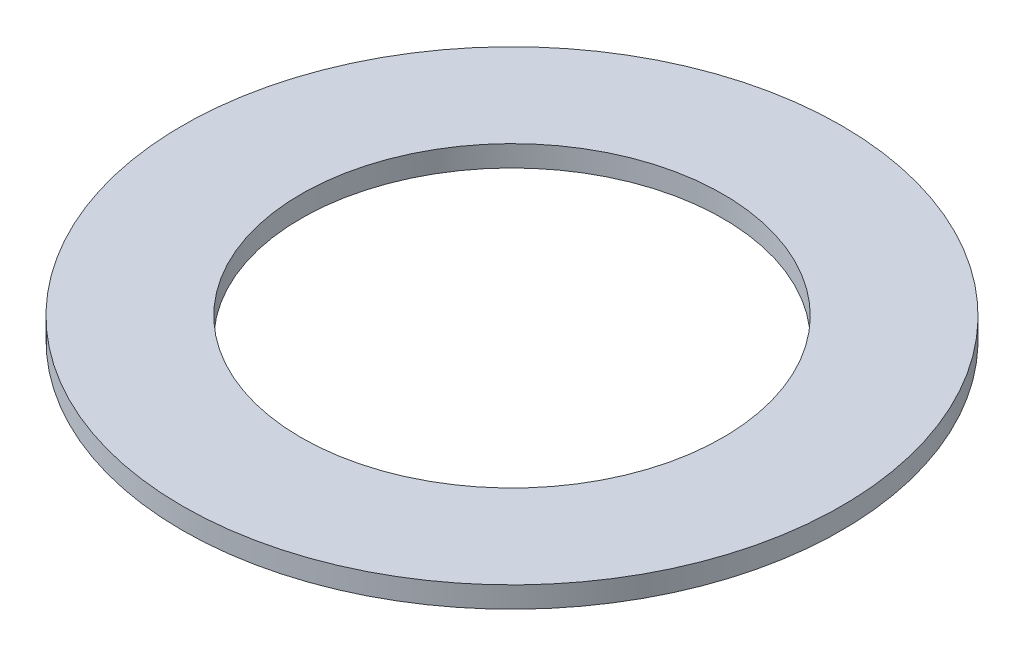
ISO-10303-21;
HEADER;
FILE_DESCRIPTION(('STEP AP214'),'2;1');
FILE_NAME('part.step','',(''),(''),'','','');
FILE_SCHEMA(('AUTOMOTIVE_DESIGN { 1 0 10303 214 1 1 1 1 }'));
ENDSEC;
DATA;
#1=APPLICATION_CONTEXT('core data for automotive mechanical design processes');
#2=APPLICATION_PROTOCOL_DEFINITION('international standard','automotive_design',2000,#1);
#3=PRODUCT_CONTEXT('',#1,'mechanical');
#4=PRODUCT('Part','Part','',(#3));
#5=PRODUCT_RELATED_PRODUCT_CATEGORY('part','',(#4));
#6=PRODUCT_DEFINITION_FORMATION('','',#4);
#7=PRODUCT_DEFINITION_CONTEXT('part definition',#1,'design');
#8=PRODUCT_DEFINITION('design','',#6,#7);
#9=PRODUCT_DEFINITION_SHAPE('','',#8);
#10=(LENGTH_UNIT() NAMED_UNIT(*) SI_UNIT(.MILLI.,.METRE.));
#11=(NAMED_UNIT(*) PLANE_ANGLE_UNIT() SI_UNIT($,.RADIAN.));
#12=(NAMED_UNIT(*) SI_UNIT($,.STERADIAN.) SOLID_ANGLE_UNIT());
#13=UNCERTAINTY_MEASURE_WITH_UNIT(LENGTH_MEASURE(1.E-05),#10,'distance_accuracy_value','');
#14=(GEOMETRIC_REPRESENTATION_CONTEXT(3) GLOBAL_UNCERTAINTY_ASSIGNED_CONTEXT((#13)) GLOBAL_UNIT_ASSIGNED_CONTEXT((#10,
#11,#12)) REPRESENTATION_CONTEXT('',''));
#15=CARTESIAN_POINT('',(0.,0.,0.));
#16=DIRECTION('',(0.,0.,1.));
#17=DIRECTION('',(1.,0.,0.));
#18=AXIS2_PLACEMENT_3D('',#15,#16,#17);
#19=CARTESIAN_POINT('',(0.,4.,0.));
#20=DIRECTION('',(0.,-1.,0.));
#21=DIRECTION('',(0.,0.,-1.));
#22=AXIS2_PLACEMENT_3D('',#19,#20,#21);
#23=CYLINDRICAL_SURFACE('',#22,62.5);
#24=CARTESIAN_POINT('',(0.,4.,0.));
#25=DIRECTION('',(0.,1.,0.));
#26=DIRECTION('',(0.,0.,1.));
#27=AXIS2_PLACEMENT_3D('',#24,#25,#26);
#28=CIRCLE('',#27,62.5);
#29=CARTESIAN_POINT('',(0.,4.,62.5));
#30=VERTEX_POINT('',#29);
#31=EDGE_CURVE('E10',#30,#30,#28,.T.);
#32=ORIENTED_EDGE('',*,*,#31,.F.);
#33=EDGE_LOOP('',(#32));
#34=FACE_BOUND('',#33,.T.);
#35=CARTESIAN_POINT('',(0.,0.,0.));
#36=DIRECTION('',(0.,1.,0.));
#37=DIRECTION('',(0.,0.,1.));
#38=AXIS2_PLACEMENT_3D('',#35,#36,#37);
#39=CIRCLE('',#38,62.5);
#40=CARTESIAN_POINT('',(0.,0.,62.5));
#41=VERTEX_POINT('',#40);
#42=EDGE_CURVE('E37',#41,#41,#39,.T.);
#43=ORIENTED_EDGE('',*,*,#42,.T.);
#44=EDGE_LOOP('',(#43));
#45=FACE_BOUND('',#44,.T.);
#46=ADVANCED_FACE('F40',(#34,#45),#23,.T.);
#47=CARTESIAN_POINT('',(0.,4.,0.));
#48=DIRECTION('',(0.,1.,0.));
#49=DIRECTION('',(0.,0.,1.));
#50=AXIS2_PLACEMENT_3D('',#47,#48,#49);
#51=PLANE('',#50);
#52=CARTESIAN_POINT('',(0.,4.,0.));
#53=DIRECTION('',(0.,1.,0.));
#54=DIRECTION('',(0.,0.,1.));
#55=AXIS2_PLACEMENT_3D('',#52,#53,#54);
#56=CIRCLE('',#55,40.);
#57=CARTESIAN_POINT('',(0.,4.,40.));
#58=VERTEX_POINT('',#57);
#59=EDGE_CURVE('E50',#58,#58,#56,.T.);
#60=ORIENTED_EDGE('',*,*,#59,.F.);
#61=EDGE_LOOP('',(#60));
#62=FACE_BOUND('',#61,.T.);
#63=ORIENTED_EDGE('',*,*,#31,.T.);
#64=EDGE_LOOP('',(#63));
#65=FACE_BOUND('',#64,.T.);
#66=ADVANCED_FACE('F59',(#62,#65),#51,.T.);
#67=CARTESIAN_POINT('',(0.,0.,0.));
#68=DIRECTION('',(0.,1.,0.));
#69=DIRECTION('',(0.,0.,1.));
#70=AXIS2_PLACEMENT_3D('',#67,#68,#69);
#71=PLANE('',#70);
#72=CARTESIAN_POINT('',(0.,0.,0.));
#73=DIRECTION('',(0.,1.,0.));
#74=DIRECTION('',(0.,0.,1.));
#75=AXIS2_PLACEMENT_3D('',#72,#73,#74);
#76=CIRCLE('',#75,40.);
#77=CARTESIAN_POINT('',(0.,0.,40.));
#78=VERTEX_POINT('',#77);
#79=EDGE_CURVE('E47',#78,#78,#76,.T.);
#80=ORIENTED_EDGE('',*,*,#79,.T.);
#81=EDGE_LOOP('',(#80));
#82=FACE_BOUND('',#81,.T.);
#83=ORIENTED_EDGE('',*,*,#42,.F.);
#84=EDGE_LOOP('',(#83));
#85=FACE_BOUND('',#84,.T.);
#86=ADVANCED_FACE('F58',(#82,#85),#71,.F.);
#87=CARTESIAN_POINT('',(0.,4.,0.));
#88=DIRECTION('',(0.,-1.,0.));
#89=DIRECTION('',(0.,0.,-1.));
#90=AXIS2_PLACEMENT_3D('',#87,#88,#89);
#91=CYLINDRICAL_SURFACE('',#90,40.);
#92=ORIENTED_EDGE('',*,*,#59,.T.);
#93=EDGE_LOOP('',(#92));
#94=FACE_BOUND('',#93,.T.);
#95=ORIENTED_EDGE('',*,*,#79,.F.);
#96=EDGE_LOOP('',(#95));
#97=FACE_BOUND('',#96,.T.);
#98=ADVANCED_FACE('F54',(#94,#97),#91,.F.);
#99=CLOSED_SHELL('',(#46,#66,#86,#98));
#100=MANIFOLD_SOLID_BREP('B2',#99);
#101=ADVANCED_BREP_SHAPE_REPRESENTATION('',(#18,#100),#14);
#102=SHAPE_DEFINITION_REPRESENTATION(#9,#101);
ENDSEC;
END-ISO-10303-21;
